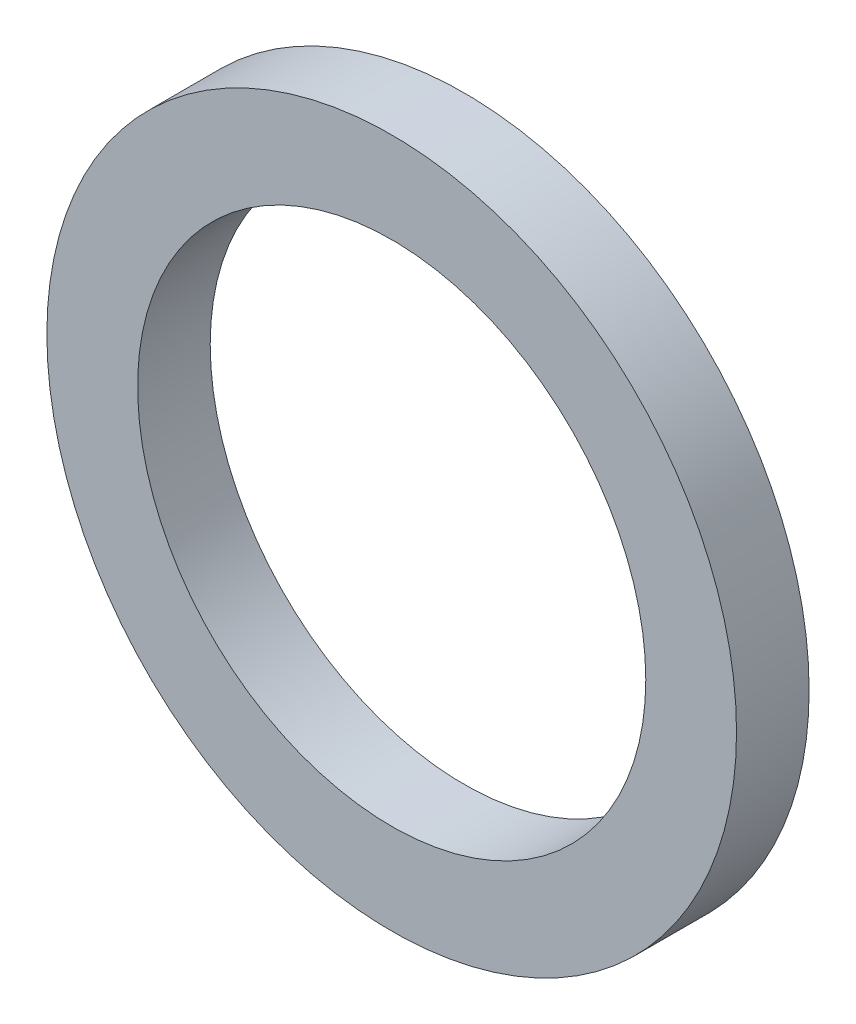
ISO-10303-21;
HEADER;
FILE_DESCRIPTION(('STEP AP214'),'2;1');
FILE_NAME('part.step','',(''),(''),'','','');
FILE_SCHEMA(('AUTOMOTIVE_DESIGN { 1 0 10303 214 1 1 1 1 }'));
ENDSEC;
DATA;
#1=APPLICATION_CONTEXT('core data for automotive mechanical design processes');
#2=APPLICATION_PROTOCOL_DEFINITION('international standard','automotive_design',2000,#1);
#3=PRODUCT_CONTEXT('',#1,'mechanical');
#4=PRODUCT('Part','Part','',(#3));
#5=PRODUCT_RELATED_PRODUCT_CATEGORY('part','',(#4));
#6=PRODUCT_DEFINITION_FORMATION('','',#4);
#7=PRODUCT_DEFINITION_CONTEXT('part definition',#1,'design');
#8=PRODUCT_DEFINITION('design','',#6,#7);
#9=PRODUCT_DEFINITION_SHAPE('','',#8);
#10=(LENGTH_UNIT() NAMED_UNIT(*) SI_UNIT(.MILLI.,.METRE.));
#11=(NAMED_UNIT(*) PLANE_ANGLE_UNIT() SI_UNIT($,.RADIAN.));
#12=(NAMED_UNIT(*) SI_UNIT($,.STERADIAN.) SOLID_ANGLE_UNIT());
#13=UNCERTAINTY_MEASURE_WITH_UNIT(LENGTH_MEASURE(1.E-05),#10,'distance_accuracy_value','');
#14=(GEOMETRIC_REPRESENTATION_CONTEXT(3) GLOBAL_UNCERTAINTY_ASSIGNED_CONTEXT((#13)) GLOBAL_UNIT_ASSIGNED_CONTEXT((#10,
#11,#12)) REPRESENTATION_CONTEXT('',''));
#15=CARTESIAN_POINT('',(0.,0.,0.));
#16=DIRECTION('',(0.,0.,1.));
#17=DIRECTION('',(1.,0.,0.));
#18=AXIS2_PLACEMENT_3D('',#15,#16,#17);
#19=CARTESIAN_POINT('',(0.,0.,0.));
#20=DIRECTION('',(0.,0.,1.));
#21=DIRECTION('',(1.,0.,0.));
#22=AXIS2_PLACEMENT_3D('',#19,#20,#21);
#23=CYLINDRICAL_SURFACE('',#22,35.);
#24=CARTESIAN_POINT('',(0.,0.,70.));
#25=DIRECTION('',(0.,0.,1.));
#26=DIRECTION('',(1.,0.,0.));
#27=AXIS2_PLACEMENT_3D('',#24,#25,#26);
#28=CIRCLE('',#27,35.);
#29=CARTESIAN_POINT('',(35.,0.,70.));
#30=VERTEX_POINT('',#29);
#31=EDGE_CURVE('E96',#30,#30,#28,.T.);
#32=ORIENTED_EDGE('',*,*,#31,.T.);
#33=EDGE_LOOP('',(#32));
#34=FACE_BOUND('',#33,.T.);
#35=CARTESIAN_POINT('',(0.,0.,60.));
#36=DIRECTION('',(0.,0.,-1.));
#37=DIRECTION('',(-1.,0.,0.));
#38=AXIS2_PLACEMENT_3D('',#35,#36,#37);
#39=CIRCLE('',#38,35.);
#40=CARTESIAN_POINT('',(-35.,0.,60.));
#41=VERTEX_POINT('',#40);
#42=EDGE_CURVE('E116',#41,#41,#39,.F.);
#43=ORIENTED_EDGE('',*,*,#42,.F.);
#44=EDGE_LOOP('',(#43));
#45=FACE_BOUND('',#44,.T.);
#46=ADVANCED_FACE('F39',(#34,#45),#23,.F.);
#47=CARTESIAN_POINT('',(0.,0.,68.));
#48=DIRECTION('',(0.,0.,-1.));
#49=DIRECTION('',(-1.,0.,0.));
#50=AXIS2_PLACEMENT_3D('',#47,#48,#49);
#51=CYLINDRICAL_SURFACE('',#50,45.);
#52=CARTESIAN_POINT('',(0.,0.,60.));
#53=DIRECTION('',(0.,0.,-1.));
#54=DIRECTION('',(-1.,0.,0.));
#55=AXIS2_PLACEMENT_3D('',#52,#53,#54);
#56=CIRCLE('',#55,45.);
#57=CARTESIAN_POINT('',(10.,-43.8748219369606,60.));
#58=VERTEX_POINT('',#57);
#59=CARTESIAN_POINT('',(-10.,-43.8748219369606,60.));
#60=VERTEX_POINT('',#59);
#61=EDGE_CURVE('E53',#58,#60,#56,.F.);
#62=ORIENTED_EDGE('',*,*,#61,.F.);
#63=DIRECTION('',(0.,0.,-1.));
#64=VECTOR('',#63,1.);
#65=CARTESIAN_POINT('',(10.,-43.8748219369606,68.));
#66=LINE('',#65,#64);
#67=CARTESIAN_POINT('',(10.,-43.8748219369606,68.));
#68=VERTEX_POINT('',#67);
#69=EDGE_CURVE('E88',#68,#58,#66,.T.);
#70=ORIENTED_EDGE('',*,*,#69,.F.);
#71=CARTESIAN_POINT('',(0.,0.,68.));
#72=DIRECTION('',(0.,0.,-1.));
#73=DIRECTION('',(-1.,0.,0.));
#74=AXIS2_PLACEMENT_3D('',#71,#72,#73);
#75=CIRCLE('',#74,45.);
#76=CARTESIAN_POINT('',(-10.,-43.8748219369606,68.));
#77=VERTEX_POINT('',#76);
#78=EDGE_CURVE('E100',#77,#68,#75,.T.);
#79=ORIENTED_EDGE('',*,*,#78,.F.);
#80=DIRECTION('',(0.,0.,-1.));
#81=VECTOR('',#80,1.);
#82=CARTESIAN_POINT('',(-10.,-43.8748219369606,68.));
#83=LINE('',#82,#81);
#84=EDGE_CURVE('E60',#77,#60,#83,.T.);
#85=ORIENTED_EDGE('',*,*,#84,.T.);
#86=EDGE_LOOP('',(#62,#70,#79,#85));
#87=FACE_BOUND('',#86,.T.);
#88=ADVANCED_FACE('F127',(#87),#51,.F.);
#89=CARTESIAN_POINT('',(0.,0.,68.));
#90=DIRECTION('',(0.,0.,-1.));
#91=DIRECTION('',(-1.,0.,0.));
#92=AXIS2_PLACEMENT_3D('',#89,#90,#91);
#93=CYLINDRICAL_SURFACE('',#92,37.);
#94=CARTESIAN_POINT('',(0.,0.,68.));
#95=DIRECTION('',(0.,0.,-1.));
#96=DIRECTION('',(-1.,0.,0.));
#97=AXIS2_PLACEMENT_3D('',#94,#95,#96);
#98=CIRCLE('',#97,37.);
#99=CARTESIAN_POINT('',(-37.,0.,68.));
#100=VERTEX_POINT('',#99);
#101=EDGE_CURVE('E103',#100,#100,#98,.T.);
#102=ORIENTED_EDGE('',*,*,#101,.T.);
#103=EDGE_LOOP('',(#102));
#104=FACE_BOUND('',#103,.T.);
#105=CARTESIAN_POINT('',(0.,0.,60.));
#106=DIRECTION('',(0.,0.,-1.));
#107=DIRECTION('',(-1.,0.,0.));
#108=AXIS2_PLACEMENT_3D('',#105,#106,#107);
#109=CIRCLE('',#108,37.);
#110=CARTESIAN_POINT('',(-37.,0.,60.));
#111=VERTEX_POINT('',#110);
#112=EDGE_CURVE('E119',#111,#111,#109,.F.);
#113=ORIENTED_EDGE('',*,*,#112,.T.);
#114=EDGE_LOOP('',(#113));
#115=FACE_BOUND('',#114,.T.);
#116=ADVANCED_FACE('F137',(#104,#115),#93,.T.);
#117=CARTESIAN_POINT('',(10.,-48.5543279942272,68.));
#118=DIRECTION('',(1.,0.,0.));
#119=DIRECTION('',(0.,0.,-1.));
#120=AXIS2_PLACEMENT_3D('',#117,#118,#119);
#121=PLANE('',#120);
#122=DIRECTION('',(0.,1.,0.));
#123=VECTOR('',#122,1.);
#124=CARTESIAN_POINT('',(10.,-48.5543279942272,60.));
#125=LINE('',#124,#123);
#126=CARTESIAN_POINT('',(10.,-46.4354390525168,60.));
#127=VERTEX_POINT('',#126);
#128=EDGE_CURVE('E122',#127,#58,#125,.T.);
#129=ORIENTED_EDGE('',*,*,#128,.F.);
#130=DIRECTION('',(0.,0.,1.));
#131=VECTOR('',#130,1.);
#132=CARTESIAN_POINT('',(10.,-46.4354390525168,60.));
#133=LINE('',#132,#131);
#134=CARTESIAN_POINT('',(10.,-46.4354390525168,68.));
#135=VERTEX_POINT('',#134);
#136=EDGE_CURVE('E87',#127,#135,#133,.T.);
#137=ORIENTED_EDGE('',*,*,#136,.T.);
#138=DIRECTION('',(0.,-1.,0.));
#139=VECTOR('',#138,1.);
#140=CARTESIAN_POINT('',(10.,-48.5543279942272,68.));
#141=LINE('',#140,#139);
#142=EDGE_CURVE('E113',#68,#135,#141,.T.);
#143=ORIENTED_EDGE('',*,*,#142,.F.);
#144=ORIENTED_EDGE('',*,*,#69,.T.);
#145=EDGE_LOOP('',(#129,#137,#143,#144));
#146=FACE_BOUND('',#145,.T.);
#147=ADVANCED_FACE('F129',(#146),#121,.F.);
#148=CARTESIAN_POINT('',(-10.,-48.5543279942272,68.));
#149=DIRECTION('',(-1.,0.,0.));
#150=DIRECTION('',(0.,0.,1.));
#151=AXIS2_PLACEMENT_3D('',#148,#149,#150);
#152=PLANE('',#151);
#153=DIRECTION('',(0.,-1.,0.));
#154=VECTOR('',#153,1.);
#155=CARTESIAN_POINT('',(-10.,-48.5543279942272,60.));
#156=LINE('',#155,#154);
#157=CARTESIAN_POINT('',(-10.,-46.4354390525168,60.));
#158=VERTEX_POINT('',#157);
#159=EDGE_CURVE('E11',#60,#158,#156,.T.);
#160=ORIENTED_EDGE('',*,*,#159,.F.);
#161=ORIENTED_EDGE('',*,*,#84,.F.);
#162=DIRECTION('',(0.,1.,0.));
#163=VECTOR('',#162,1.);
#164=CARTESIAN_POINT('',(-10.,-48.5543279942272,68.));
#165=LINE('',#164,#163);
#166=CARTESIAN_POINT('',(-10.,-46.4354390525168,68.));
#167=VERTEX_POINT('',#166);
#168=EDGE_CURVE('E84',#167,#77,#165,.T.);
#169=ORIENTED_EDGE('',*,*,#168,.F.);
#170=DIRECTION('',(0.,0.,1.));
#171=VECTOR('',#170,1.);
#172=CARTESIAN_POINT('',(-10.,-46.4354390525168,60.));
#173=LINE('',#172,#171);
#174=EDGE_CURVE('E82',#167,#158,#173,.F.);
#175=ORIENTED_EDGE('',*,*,#174,.T.);
#176=EDGE_LOOP('',(#160,#161,#169,#175));
#177=FACE_BOUND('',#176,.T.);
#178=ADVANCED_FACE('F83',(#177),#152,.F.);
#179=CARTESIAN_POINT('',(0.,0.,60.));
#180=DIRECTION('',(0.,0.,1.));
#181=DIRECTION('',(1.,0.,0.));
#182=AXIS2_PLACEMENT_3D('',#179,#180,#181);
#183=CYLINDRICAL_SURFACE('',#182,47.5);
#184=ORIENTED_EDGE('',*,*,#136,.F.);
#185=CARTESIAN_POINT('',(0.,0.,60.));
#186=DIRECTION('',(0.,0.,1.));
#187=DIRECTION('',(1.,0.,0.));
#188=AXIS2_PLACEMENT_3D('',#185,#186,#187);
#189=CIRCLE('',#188,47.5);
#190=EDGE_CURVE('E47',#127,#158,#189,.T.);
#191=ORIENTED_EDGE('',*,*,#190,.T.);
#192=ORIENTED_EDGE('',*,*,#174,.F.);
#193=CARTESIAN_POINT('',(0.,0.,68.));
#194=DIRECTION('',(0.,0.,1.));
#195=DIRECTION('',(1.,0.,0.));
#196=AXIS2_PLACEMENT_3D('',#193,#194,#195);
#197=CIRCLE('',#196,47.5);
#198=EDGE_CURVE('E106',#135,#167,#197,.F.);
#199=ORIENTED_EDGE('',*,*,#198,.F.);
#200=EDGE_LOOP('',(#184,#191,#192,#199));
#201=FACE_BOUND('',#200,.T.);
#202=CARTESIAN_POINT('',(0.,0.,70.));
#203=DIRECTION('',(0.,0.,1.));
#204=DIRECTION('',(1.,0.,0.));
#205=AXIS2_PLACEMENT_3D('',#202,#203,#204);
#206=CIRCLE('',#205,47.5);
#207=CARTESIAN_POINT('',(47.5,0.,70.));
#208=VERTEX_POINT('',#207);
#209=EDGE_CURVE('E93',#208,#208,#206,.T.);
#210=ORIENTED_EDGE('',*,*,#209,.F.);
#211=EDGE_LOOP('',(#210));
#212=FACE_BOUND('',#211,.T.);
#213=ADVANCED_FACE('F91',(#201,#212),#183,.T.);
#214=CARTESIAN_POINT('',(0.,0.,70.));
#215=DIRECTION('',(0.,0.,1.));
#216=DIRECTION('',(1.,0.,0.));
#217=AXIS2_PLACEMENT_3D('',#214,#215,#216);
#218=PLANE('',#217);
#219=ORIENTED_EDGE('',*,*,#31,.F.);
#220=EDGE_LOOP('',(#219));
#221=FACE_BOUND('',#220,.T.);
#222=ORIENTED_EDGE('',*,*,#209,.T.);
#223=EDGE_LOOP('',(#222));
#224=FACE_BOUND('',#223,.T.);
#225=ADVANCED_FACE('F41',(#221,#224),#218,.T.);
#226=CARTESIAN_POINT('',(0.,0.,68.));
#227=DIRECTION('',(0.,0.,-1.));
#228=DIRECTION('',(-1.,0.,0.));
#229=AXIS2_PLACEMENT_3D('',#226,#227,#228);
#230=PLANE('',#229);
#231=ORIENTED_EDGE('',*,*,#78,.T.);
#232=ORIENTED_EDGE('',*,*,#142,.T.);
#233=ORIENTED_EDGE('',*,*,#198,.T.);
#234=ORIENTED_EDGE('',*,*,#168,.T.);
#235=EDGE_LOOP('',(#231,#232,#233,#234));
#236=FACE_BOUND('',#235,.T.);
#237=ORIENTED_EDGE('',*,*,#101,.F.);
#238=EDGE_LOOP('',(#237));
#239=FACE_BOUND('',#238,.T.);
#240=ADVANCED_FACE('F131',(#236,#239),#230,.T.);
#241=CARTESIAN_POINT('',(-48.5,48.5,60.));
#242=DIRECTION('',(0.,0.,-1.));
#243=DIRECTION('',(-1.,0.,0.));
#244=AXIS2_PLACEMENT_3D('',#241,#242,#243);
#245=PLANE('',#244);
#246=ORIENTED_EDGE('',*,*,#128,.T.);
#247=ORIENTED_EDGE('',*,*,#61,.T.);
#248=ORIENTED_EDGE('',*,*,#159,.T.);
#249=ORIENTED_EDGE('',*,*,#190,.F.);
#250=EDGE_LOOP('',(#246,#247,#248,#249));
#251=FACE_BOUND('',#250,.T.);
#252=ADVANCED_FACE('F78',(#251),#245,.T.);
#253=ORIENTED_EDGE('',*,*,#112,.F.);
#254=EDGE_LOOP('',(#253));
#255=FACE_BOUND('',#254,.T.);
#256=ORIENTED_EDGE('',*,*,#42,.T.);
#257=EDGE_LOOP('',(#256));
#258=FACE_BOUND('',#257,.T.);
#259=ADVANCED_FACE('F143',(#255,#258),#245,.T.);
#260=CLOSED_SHELL('',(#46,#88,#116,#147,#178,#213,#225,#240,#252,#259));
#261=MANIFOLD_SOLID_BREP('B2',#260);
#262=ADVANCED_BREP_SHAPE_REPRESENTATION('',(#18,#261),#14);
#263=SHAPE_DEFINITION_REPRESENTATION(#9,#262);
ENDSEC;
END-ISO-10303-21;
